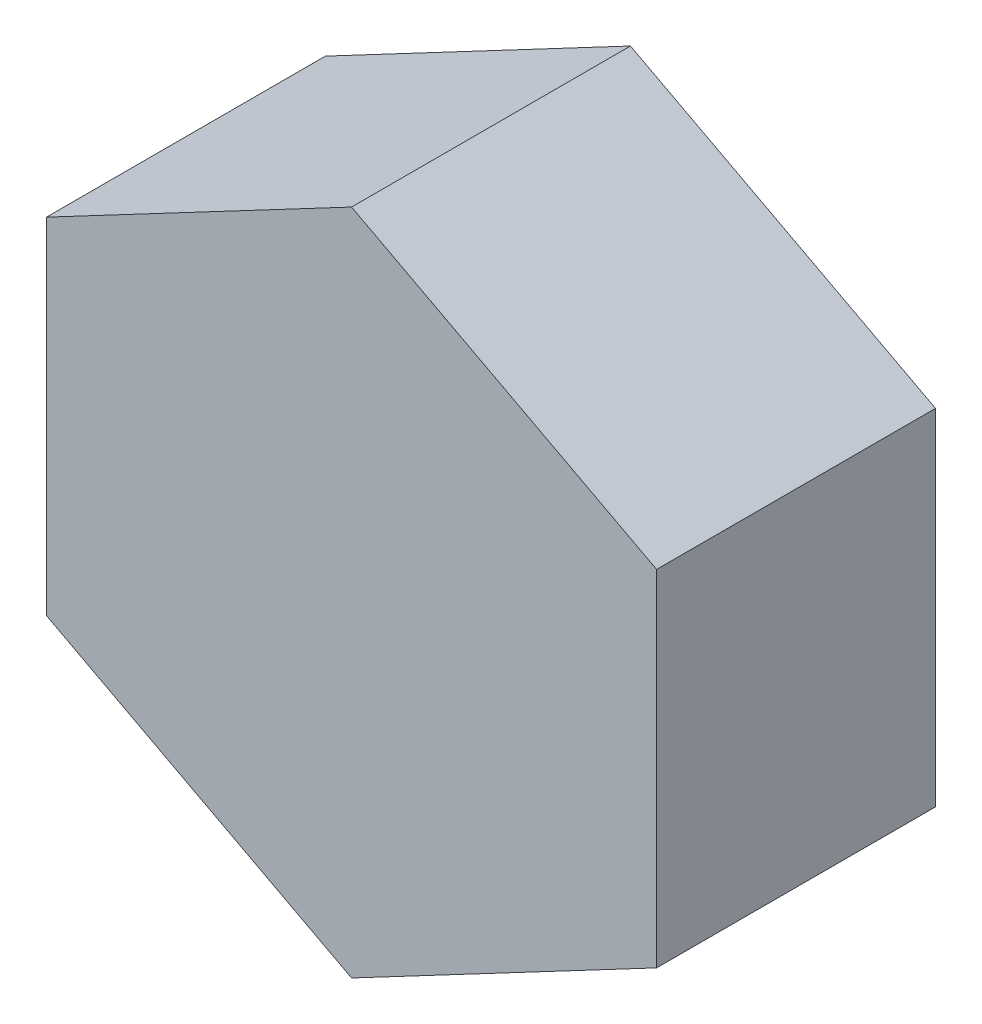
ISO-10303-21;
HEADER;
FILE_DESCRIPTION(('STEP AP214'),'2;1');
FILE_NAME('part.step','',(''),(''),'','','');
FILE_SCHEMA(('AUTOMOTIVE_DESIGN { 1 0 10303 214 1 1 1 1 }'));
ENDSEC;
DATA;
#1=APPLICATION_CONTEXT('core data for automotive mechanical design processes');
#2=APPLICATION_PROTOCOL_DEFINITION('international standard','automotive_design',2000,#1);
#3=PRODUCT_CONTEXT('',#1,'mechanical');
#4=PRODUCT('Part','Part','',(#3));
#5=PRODUCT_RELATED_PRODUCT_CATEGORY('part','',(#4));
#6=PRODUCT_DEFINITION_FORMATION('','',#4);
#7=PRODUCT_DEFINITION_CONTEXT('part definition',#1,'design');
#8=PRODUCT_DEFINITION('design','',#6,#7);
#9=PRODUCT_DEFINITION_SHAPE('','',#8);
#10=(LENGTH_UNIT() NAMED_UNIT(*) SI_UNIT(.MILLI.,.METRE.));
#11=(NAMED_UNIT(*) PLANE_ANGLE_UNIT() SI_UNIT($,.RADIAN.));
#12=(NAMED_UNIT(*) SI_UNIT($,.STERADIAN.) SOLID_ANGLE_UNIT());
#13=UNCERTAINTY_MEASURE_WITH_UNIT(LENGTH_MEASURE(1.E-05),#10,'distance_accuracy_value','');
#14=(GEOMETRIC_REPRESENTATION_CONTEXT(3) GLOBAL_UNCERTAINTY_ASSIGNED_CONTEXT((#13)) GLOBAL_UNIT_ASSIGNED_CONTEXT((#10,
#11,#12)) REPRESENTATION_CONTEXT('',''));
#15=CARTESIAN_POINT('',(0.,0.,0.));
#16=DIRECTION('',(0.,0.,1.));
#17=DIRECTION('',(1.,0.,0.));
#18=AXIS2_PLACEMENT_3D('',#15,#16,#17);
#19=CARTESIAN_POINT('',(3.49999999999999,-1.97953425533499,3.2));
#20=DIRECTION('',(-0.999999999999999,0.,0.));
#21=DIRECTION('',(0.,-0.999999999999999,0.));
#22=AXIS2_PLACEMENT_3D('',#19,#20,#21);
#23=PLANE('',#22);
#24=DIRECTION('',(0.,0.999999999999999,0.));
#25=VECTOR('',#24,1.);
#26=CARTESIAN_POINT('',(3.49999999999999,-1.97953425533499,0.));
#27=LINE('',#26,#25);
#28=CARTESIAN_POINT('',(3.49999999999999,-1.97953425533499,0.));
#29=VERTEX_POINT('',#28);
#30=CARTESIAN_POINT('',(3.49999999999999,1.97953425533499,0.));
#31=VERTEX_POINT('',#30);
#32=EDGE_CURVE('E121',#29,#31,#27,.T.);
#33=ORIENTED_EDGE('',*,*,#32,.T.);
#34=DIRECTION('',(0.,0.,-0.999999999999999));
#35=VECTOR('',#34,1.);
#36=CARTESIAN_POINT('',(3.49999999999999,1.97953425533499,3.2));
#37=LINE('',#36,#35);
#38=CARTESIAN_POINT('',(3.49999999999999,1.97953425533499,3.2));
#39=VERTEX_POINT('',#38);
#40=EDGE_CURVE('E11',#39,#31,#37,.T.);
#41=ORIENTED_EDGE('',*,*,#40,.F.);
#42=DIRECTION('',(0.,0.999999999999999,0.));
#43=VECTOR('',#42,1.);
#44=CARTESIAN_POINT('',(3.49999999999999,-1.97953425533499,3.2));
#45=LINE('',#44,#43);
#46=CARTESIAN_POINT('',(3.49999999999999,-1.97953425533499,3.2));
#47=VERTEX_POINT('',#46);
#48=EDGE_CURVE('E131',#47,#39,#45,.T.);
#49=ORIENTED_EDGE('',*,*,#48,.F.);
#50=DIRECTION('',(0.,0.,-0.999999999999999));
#51=VECTOR('',#50,1.);
#52=CARTESIAN_POINT('',(3.49999999999999,-1.97953425533499,3.2));
#53=LINE('',#52,#51);
#54=EDGE_CURVE('E117',#47,#29,#53,.T.);
#55=ORIENTED_EDGE('',*,*,#54,.T.);
#56=EDGE_LOOP('',(#33,#41,#49,#55));
#57=FACE_BOUND('',#56,.T.);
#58=ADVANCED_FACE('F37',(#57),#23,.F.);
#59=CARTESIAN_POINT('',(3.49999999999999,1.97953425533499,3.2));
#60=DIRECTION('',(-0.467399273257805,-0.884046333264312,0.));
#61=DIRECTION('',(0.884046333264312,-0.467399273257805,0.));
#62=AXIS2_PLACEMENT_3D('',#59,#60,#61);
#63=PLANE('',#62);
#64=DIRECTION('',(-0.884046333264312,0.467399273257805,0.));
#65=VECTOR('',#64,1.);
#66=CARTESIAN_POINT('',(3.49999999999999,1.97953425533499,0.));
#67=LINE('',#66,#65);
#68=CARTESIAN_POINT('',(0.,3.82999999999999,0.));
#69=VERTEX_POINT('',#68);
#70=EDGE_CURVE('E124',#31,#69,#67,.T.);
#71=ORIENTED_EDGE('',*,*,#70,.T.);
#72=DIRECTION('',(0.,0.,-0.999999999999999));
#73=VECTOR('',#72,1.);
#74=CARTESIAN_POINT('',(0.,3.82999999999999,3.2));
#75=LINE('',#74,#73);
#76=CARTESIAN_POINT('',(0.,3.82999999999999,3.2));
#77=VERTEX_POINT('',#76);
#78=EDGE_CURVE('E45',#77,#69,#75,.T.);
#79=ORIENTED_EDGE('',*,*,#78,.F.);
#80=DIRECTION('',(-0.884046333264312,0.467399273257805,0.));
#81=VECTOR('',#80,1.);
#82=CARTESIAN_POINT('',(3.49999999999999,1.97953425533499,3.2));
#83=LINE('',#82,#81);
#84=EDGE_CURVE('E90',#39,#77,#83,.T.);
#85=ORIENTED_EDGE('',*,*,#84,.F.);
#86=ORIENTED_EDGE('',*,*,#40,.T.);
#87=EDGE_LOOP('',(#71,#79,#85,#86));
#88=FACE_BOUND('',#87,.T.);
#89=ADVANCED_FACE('F155',(#88),#63,.F.);
#90=CARTESIAN_POINT('',(0.,3.82999999999999,3.2));
#91=DIRECTION('',(0.467399273257805,-0.884046333264312,0.));
#92=DIRECTION('',(0.884046333264313,0.467399273257805,0.));
#93=AXIS2_PLACEMENT_3D('',#90,#91,#92);
#94=PLANE('',#93);
#95=DIRECTION('',(-0.884046333264312,-0.467399273257805,0.));
#96=VECTOR('',#95,1.);
#97=CARTESIAN_POINT('',(0.,3.82999999999999,0.));
#98=LINE('',#97,#96);
#99=CARTESIAN_POINT('',(-3.5,1.97953425533499,0.));
#100=VERTEX_POINT('',#99);
#101=EDGE_CURVE('E126',#69,#100,#98,.T.);
#102=ORIENTED_EDGE('',*,*,#101,.T.);
#103=DIRECTION('',(0.,0.,-0.999999999999999));
#104=VECTOR('',#103,1.);
#105=CARTESIAN_POINT('',(-3.5,1.97953425533499,3.2));
#106=LINE('',#105,#104);
#107=CARTESIAN_POINT('',(-3.5,1.97953425533499,3.2));
#108=VERTEX_POINT('',#107);
#109=EDGE_CURVE('E112',#108,#100,#106,.T.);
#110=ORIENTED_EDGE('',*,*,#109,.F.);
#111=DIRECTION('',(-0.884046333264312,-0.467399273257805,0.));
#112=VECTOR('',#111,1.);
#113=CARTESIAN_POINT('',(0.,3.82999999999999,3.2));
#114=LINE('',#113,#112);
#115=EDGE_CURVE('E103',#77,#108,#114,.T.);
#116=ORIENTED_EDGE('',*,*,#115,.F.);
#117=ORIENTED_EDGE('',*,*,#78,.T.);
#118=EDGE_LOOP('',(#102,#110,#116,#117));
#119=FACE_BOUND('',#118,.T.);
#120=ADVANCED_FACE('F137',(#119),#94,.F.);
#121=CARTESIAN_POINT('',(-3.5,1.97953425533499,3.2));
#122=DIRECTION('',(0.999999999999999,0.,0.));
#123=DIRECTION('',(0.,0.999999999999999,0.));
#124=AXIS2_PLACEMENT_3D('',#121,#122,#123);
#125=PLANE('',#124);
#126=DIRECTION('',(0.,-0.999999999999999,0.));
#127=VECTOR('',#126,1.);
#128=CARTESIAN_POINT('',(-3.5,1.97953425533499,0.));
#129=LINE('',#128,#127);
#130=CARTESIAN_POINT('',(-3.49999999999999,-1.979534255335,0.));
#131=VERTEX_POINT('',#130);
#132=EDGE_CURVE('E111',#100,#131,#129,.T.);
#133=ORIENTED_EDGE('',*,*,#132,.T.);
#134=DIRECTION('',(0.,0.,-0.999999999999999));
#135=VECTOR('',#134,1.);
#136=CARTESIAN_POINT('',(-3.49999999999999,-1.979534255335,3.2));
#137=LINE('',#136,#135);
#138=CARTESIAN_POINT('',(-3.49999999999999,-1.979534255335,3.2));
#139=VERTEX_POINT('',#138);
#140=EDGE_CURVE('E108',#139,#131,#137,.T.);
#141=ORIENTED_EDGE('',*,*,#140,.F.);
#142=DIRECTION('',(0.,-0.999999999999999,0.));
#143=VECTOR('',#142,1.);
#144=CARTESIAN_POINT('',(-3.5,1.97953425533499,3.2));
#145=LINE('',#144,#143);
#146=EDGE_CURVE('E97',#108,#139,#145,.T.);
#147=ORIENTED_EDGE('',*,*,#146,.F.);
#148=ORIENTED_EDGE('',*,*,#109,.T.);
#149=EDGE_LOOP('',(#133,#141,#147,#148));
#150=FACE_BOUND('',#149,.T.);
#151=ADVANCED_FACE('F109',(#150),#125,.F.);
#152=CARTESIAN_POINT('',(-3.49999999999999,-1.979534255335,3.2));
#153=DIRECTION('',(0.467399273257805,0.884046333264312,0.));
#154=DIRECTION('',(-0.884046333264312,0.467399273257805,0.));
#155=AXIS2_PLACEMENT_3D('',#152,#153,#154);
#156=PLANE('',#155);
#157=DIRECTION('',(0.884046333264312,-0.467399273257805,0.));
#158=VECTOR('',#157,1.);
#159=CARTESIAN_POINT('',(-3.49999999999999,-1.979534255335,0.));
#160=LINE('',#159,#158);
#161=CARTESIAN_POINT('',(0.,-3.83,0.));
#162=VERTEX_POINT('',#161);
#163=EDGE_CURVE('E76',#131,#162,#160,.T.);
#164=ORIENTED_EDGE('',*,*,#163,.T.);
#165=DIRECTION('',(0.,0.,-0.999999999999999));
#166=VECTOR('',#165,1.);
#167=CARTESIAN_POINT('',(0.,-3.83,3.2));
#168=LINE('',#167,#166);
#169=CARTESIAN_POINT('',(0.,-3.83,3.2));
#170=VERTEX_POINT('',#169);
#171=EDGE_CURVE('E113',#170,#162,#168,.T.);
#172=ORIENTED_EDGE('',*,*,#171,.F.);
#173=DIRECTION('',(0.884046333264312,-0.467399273257805,0.));
#174=VECTOR('',#173,1.);
#175=CARTESIAN_POINT('',(-3.49999999999999,-1.979534255335,3.2));
#176=LINE('',#175,#174);
#177=EDGE_CURVE('E101',#139,#170,#176,.T.);
#178=ORIENTED_EDGE('',*,*,#177,.F.);
#179=ORIENTED_EDGE('',*,*,#140,.T.);
#180=EDGE_LOOP('',(#164,#172,#178,#179));
#181=FACE_BOUND('',#180,.T.);
#182=ADVANCED_FACE('F115',(#181),#156,.F.);
#183=CARTESIAN_POINT('',(0.,-3.83,3.2));
#184=DIRECTION('',(-0.467399273257805,0.884046333264312,0.));
#185=DIRECTION('',(-0.884046333264312,-0.467399273257805,0.));
#186=AXIS2_PLACEMENT_3D('',#183,#184,#185);
#187=PLANE('',#186);
#188=DIRECTION('',(0.884046333264312,0.467399273257805,0.));
#189=VECTOR('',#188,1.);
#190=CARTESIAN_POINT('',(0.,-3.83,0.));
#191=LINE('',#190,#189);
#192=EDGE_CURVE('E82',#162,#29,#191,.T.);
#193=ORIENTED_EDGE('',*,*,#192,.T.);
#194=ORIENTED_EDGE('',*,*,#54,.F.);
#195=DIRECTION('',(0.884046333264312,0.467399273257805,0.));
#196=VECTOR('',#195,1.);
#197=CARTESIAN_POINT('',(0.,-3.83,3.2));
#198=LINE('',#197,#196);
#199=EDGE_CURVE('E53',#170,#47,#198,.T.);
#200=ORIENTED_EDGE('',*,*,#199,.F.);
#201=ORIENTED_EDGE('',*,*,#171,.T.);
#202=EDGE_LOOP('',(#193,#194,#200,#201));
#203=FACE_BOUND('',#202,.T.);
#204=ADVANCED_FACE('F144',(#203),#187,.F.);
#205=CARTESIAN_POINT('',(0.,0.,3.2));
#206=DIRECTION('',(0.,0.,0.999999999999999));
#207=DIRECTION('',(1.,0.,0.));
#208=AXIS2_PLACEMENT_3D('',#205,#206,#207);
#209=PLANE('',#208);
#210=ORIENTED_EDGE('',*,*,#48,.T.);
#211=ORIENTED_EDGE('',*,*,#84,.T.);
#212=ORIENTED_EDGE('',*,*,#115,.T.);
#213=ORIENTED_EDGE('',*,*,#146,.T.);
#214=ORIENTED_EDGE('',*,*,#177,.T.);
#215=ORIENTED_EDGE('',*,*,#199,.T.);
#216=EDGE_LOOP('',(#210,#211,#212,#213,#214,#215));
#217=FACE_BOUND('',#216,.T.);
#218=ADVANCED_FACE('F99',(#217),#209,.T.);
#219=CARTESIAN_POINT('',(0.,0.,0.));
#220=DIRECTION('',(0.,0.,0.999999999999999));
#221=DIRECTION('',(1.,0.,0.));
#222=AXIS2_PLACEMENT_3D('',#219,#220,#221);
#223=PLANE('',#222);
#224=ORIENTED_EDGE('',*,*,#32,.F.);
#225=ORIENTED_EDGE('',*,*,#192,.F.);
#226=ORIENTED_EDGE('',*,*,#163,.F.);
#227=ORIENTED_EDGE('',*,*,#132,.F.);
#228=ORIENTED_EDGE('',*,*,#101,.F.);
#229=ORIENTED_EDGE('',*,*,#70,.F.);
#230=EDGE_LOOP('',(#224,#225,#226,#227,#228,#229));
#231=FACE_BOUND('',#230,.T.);
#232=ADVANCED_FACE('F140',(#231),#223,.F.);
#233=CLOSED_SHELL('',(#58,#89,#120,#151,#182,#204,#218,#232));
#234=MANIFOLD_SOLID_BREP('B2',#233);
#235=ADVANCED_BREP_SHAPE_REPRESENTATION('',(#18,#234),#14);
#236=SHAPE_DEFINITION_REPRESENTATION(#9,#235);
ENDSEC;
END-ISO-10303-21;
